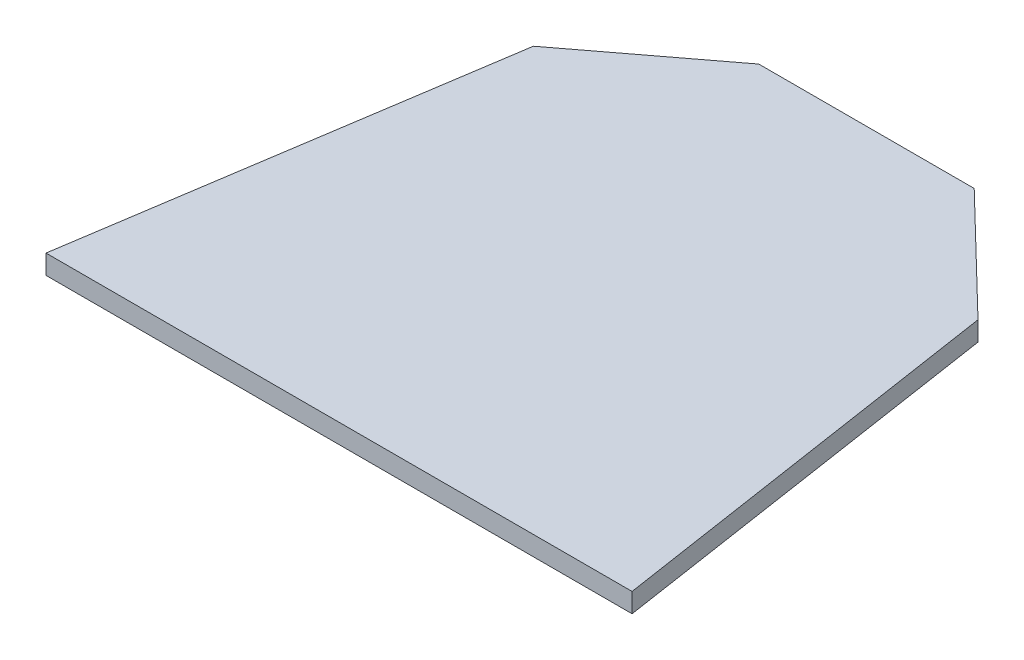
ISO-10303-21;
HEADER;
FILE_DESCRIPTION(('STEP AP214'),'2;1');
FILE_NAME('part.step','',(''),(''),'','','');
FILE_SCHEMA(('AUTOMOTIVE_DESIGN { 1 0 10303 214 1 1 1 1 }'));
ENDSEC;
DATA;
#1=APPLICATION_CONTEXT('core data for automotive mechanical design processes');
#2=APPLICATION_PROTOCOL_DEFINITION('international standard','automotive_design',2000,#1);
#3=PRODUCT_CONTEXT('',#1,'mechanical');
#4=PRODUCT('Part','Part','',(#3));
#5=PRODUCT_RELATED_PRODUCT_CATEGORY('part','',(#4));
#6=PRODUCT_DEFINITION_FORMATION('','',#4);
#7=PRODUCT_DEFINITION_CONTEXT('part definition',#1,'design');
#8=PRODUCT_DEFINITION('design','',#6,#7);
#9=PRODUCT_DEFINITION_SHAPE('','',#8);
#10=(LENGTH_UNIT() NAMED_UNIT(*) SI_UNIT(.MILLI.,.METRE.));
#11=(NAMED_UNIT(*) PLANE_ANGLE_UNIT() SI_UNIT($,.RADIAN.));
#12=(NAMED_UNIT(*) SI_UNIT($,.STERADIAN.) SOLID_ANGLE_UNIT());
#13=UNCERTAINTY_MEASURE_WITH_UNIT(LENGTH_MEASURE(1.E-05),#10,'distance_accuracy_value','');
#14=(GEOMETRIC_REPRESENTATION_CONTEXT(3) GLOBAL_UNCERTAINTY_ASSIGNED_CONTEXT((#13)) GLOBAL_UNIT_ASSIGNED_CONTEXT((#10,
#11,#12)) REPRESENTATION_CONTEXT('',''));
#15=CARTESIAN_POINT('',(0.,0.,0.));
#16=DIRECTION('',(0.,0.,1.));
#17=DIRECTION('',(1.,0.,0.));
#18=AXIS2_PLACEMENT_3D('',#15,#16,#17);
#19=CARTESIAN_POINT('',(0.,2.,0.));
#20=DIRECTION('',(0.,0.,-1.));
#21=DIRECTION('',(-1.,0.,0.));
#22=AXIS2_PLACEMENT_3D('',#19,#20,#21);
#23=PLANE('',#22);
#24=DIRECTION('',(1.,0.,0.));
#25=VECTOR('',#24,1.);
#26=CARTESIAN_POINT('',(0.,0.,0.));
#27=LINE('',#26,#25);
#28=CARTESIAN_POINT('',(0.,0.,0.));
#29=VERTEX_POINT('',#28);
#30=CARTESIAN_POINT('',(60.5101327695278,0.,0.));
#31=VERTEX_POINT('',#30);
#32=EDGE_CURVE('E128',#29,#31,#27,.T.);
#33=ORIENTED_EDGE('',*,*,#32,.T.);
#34=DIRECTION('',(0.,-1.,0.));
#35=VECTOR('',#34,1.);
#36=CARTESIAN_POINT('',(60.5101327695278,2.,0.));
#37=LINE('',#36,#35);
#38=CARTESIAN_POINT('',(60.5101327695278,2.,0.));
#39=VERTEX_POINT('',#38);
#40=EDGE_CURVE('E11',#39,#31,#37,.T.);
#41=ORIENTED_EDGE('',*,*,#40,.F.);
#42=DIRECTION('',(1.,0.,0.));
#43=VECTOR('',#42,1.);
#44=CARTESIAN_POINT('',(0.,2.,0.));
#45=LINE('',#44,#43);
#46=CARTESIAN_POINT('',(0.,2.,0.));
#47=VERTEX_POINT('',#46);
#48=EDGE_CURVE('E144',#47,#39,#45,.T.);
#49=ORIENTED_EDGE('',*,*,#48,.F.);
#50=DIRECTION('',(0.,-1.,0.));
#51=VECTOR('',#50,1.);
#52=CARTESIAN_POINT('',(0.,2.,0.));
#53=LINE('',#52,#51);
#54=EDGE_CURVE('E124',#47,#29,#53,.T.);
#55=ORIENTED_EDGE('',*,*,#54,.T.);
#56=EDGE_LOOP('',(#33,#41,#49,#55));
#57=FACE_BOUND('',#56,.T.);
#58=ADVANCED_FACE('F39',(#57),#23,.F.);
#59=CARTESIAN_POINT('',(60.5101327695278,2.,0.));
#60=DIRECTION('',(-0.988543541670896,0.,0.150935967286669));
#61=DIRECTION('',(0.150935967286669,0.,0.988543541670896));
#62=AXIS2_PLACEMENT_3D('',#59,#60,#61);
#63=PLANE('',#62);
#64=DIRECTION('',(-0.150935967286669,0.,-0.988543541670895));
#65=VECTOR('',#64,1.);
#66=CARTESIAN_POINT('',(60.5101327695278,0.,0.));
#67=LINE('',#66,#65);
#68=CARTESIAN_POINT('',(54.0745583670512,0.,-42.1493009709734));
#69=VERTEX_POINT('',#68);
#70=EDGE_CURVE('E132',#31,#69,#67,.T.);
#71=ORIENTED_EDGE('',*,*,#70,.T.);
#72=DIRECTION('',(0.,-1.,0.));
#73=VECTOR('',#72,1.);
#74=CARTESIAN_POINT('',(54.0745583670512,2.,-42.1493009709734));
#75=LINE('',#74,#73);
#76=CARTESIAN_POINT('',(54.0745583670512,2.,-42.1493009709734));
#77=VERTEX_POINT('',#76);
#78=EDGE_CURVE('E48',#77,#69,#75,.T.);
#79=ORIENTED_EDGE('',*,*,#78,.F.);
#80=DIRECTION('',(-0.150935967286669,0.,-0.988543541670895));
#81=VECTOR('',#80,1.);
#82=CARTESIAN_POINT('',(60.5101327695278,2.,0.));
#83=LINE('',#82,#81);
#84=EDGE_CURVE('E93',#39,#77,#83,.T.);
#85=ORIENTED_EDGE('',*,*,#84,.F.);
#86=ORIENTED_EDGE('',*,*,#40,.T.);
#87=EDGE_LOOP('',(#71,#79,#85,#86));
#88=FACE_BOUND('',#87,.T.);
#89=ADVANCED_FACE('F172',(#88),#63,.F.);
#90=CARTESIAN_POINT('',(54.0745583670512,2.,-42.1493009709734));
#91=DIRECTION('',(-0.695214186381072,0.,0.718802639849426));
#92=DIRECTION('',(0.718802639849426,0.,0.695214186381072));
#93=AXIS2_PLACEMENT_3D('',#90,#91,#92);
#94=PLANE('',#93);
#95=DIRECTION('',(-0.718802639849426,0.,-0.695214186381072));
#96=VECTOR('',#95,1.);
#97=CARTESIAN_POINT('',(54.0745583670512,0.,-42.1493009709734));
#98=LINE('',#97,#96);
#99=CARTESIAN_POINT('',(42.1382999084905,0.,-53.6938554184094));
#100=VERTEX_POINT('',#99);
#101=EDGE_CURVE('E135',#69,#100,#98,.T.);
#102=ORIENTED_EDGE('',*,*,#101,.T.);
#103=DIRECTION('',(0.,-1.,0.));
#104=VECTOR('',#103,1.);
#105=CARTESIAN_POINT('',(42.1382999084905,2.,-53.6938554184094));
#106=LINE('',#105,#104);
#107=CARTESIAN_POINT('',(42.1382999084905,2.,-53.6938554184094));
#108=VERTEX_POINT('',#107);
#109=EDGE_CURVE('E117',#108,#100,#106,.T.);
#110=ORIENTED_EDGE('',*,*,#109,.F.);
#111=DIRECTION('',(-0.718802639849426,0.,-0.695214186381072));
#112=VECTOR('',#111,1.);
#113=CARTESIAN_POINT('',(54.0745583670512,2.,-42.1493009709734));
#114=LINE('',#113,#112);
#115=EDGE_CURVE('E106',#77,#108,#114,.T.);
#116=ORIENTED_EDGE('',*,*,#115,.F.);
#117=ORIENTED_EDGE('',*,*,#78,.T.);
#118=EDGE_LOOP('',(#102,#110,#116,#117));
#119=FACE_BOUND('',#118,.T.);
#120=ADVANCED_FACE('F154',(#119),#94,.F.);
#121=CARTESIAN_POINT('',(42.1382999084905,2.,-53.6938554184094));
#122=DIRECTION('',(0.,0.,1.));
#123=DIRECTION('',(1.,0.,0.));
#124=AXIS2_PLACEMENT_3D('',#121,#122,#123);
#125=PLANE('',#124);
#126=DIRECTION('',(-1.,0.,0.));
#127=VECTOR('',#126,1.);
#128=CARTESIAN_POINT('',(42.1382999084905,0.,-53.6938554184094));
#129=LINE('',#128,#127);
#130=CARTESIAN_POINT('',(19.8982463869477,0.,-53.6938554184094));
#131=VERTEX_POINT('',#130);
#132=EDGE_CURVE('E115',#100,#131,#129,.T.);
#133=ORIENTED_EDGE('',*,*,#132,.T.);
#134=DIRECTION('',(0.,-1.,0.));
#135=VECTOR('',#134,1.);
#136=CARTESIAN_POINT('',(19.8982463869477,2.,-53.6938554184094));
#137=LINE('',#136,#135);
#138=CARTESIAN_POINT('',(19.8982463869477,2.,-53.6938554184094));
#139=VERTEX_POINT('',#138);
#140=EDGE_CURVE('E112',#139,#131,#137,.T.);
#141=ORIENTED_EDGE('',*,*,#140,.F.);
#142=DIRECTION('',(-1.,0.,0.));
#143=VECTOR('',#142,1.);
#144=CARTESIAN_POINT('',(42.1382999084905,2.,-53.6938554184094));
#145=LINE('',#144,#143);
#146=EDGE_CURVE('E100',#108,#139,#145,.T.);
#147=ORIENTED_EDGE('',*,*,#146,.F.);
#148=ORIENTED_EDGE('',*,*,#109,.T.);
#149=EDGE_LOOP('',(#133,#141,#147,#148));
#150=FACE_BOUND('',#149,.T.);
#151=ADVANCED_FACE('F113',(#150),#125,.F.);
#152=CARTESIAN_POINT('',(19.8982463869477,2.,-53.6938554184094));
#153=DIRECTION('',(0.60437936380127,0.,0.796696670390414));
#154=DIRECTION('',(0.796696670390414,0.,-0.60437936380127));
#155=AXIS2_PLACEMENT_3D('',#152,#153,#154);
#156=PLANE('',#155);
#157=DIRECTION('',(-0.796696670390414,0.,0.60437936380127));
#158=VECTOR('',#157,1.);
#159=CARTESIAN_POINT('',(19.8982463869477,0.,-53.6938554184094));
#160=LINE('',#159,#158);
#161=CARTESIAN_POINT('',(6.66553893152044,0.,-43.6554360167565));
#162=VERTEX_POINT('',#161);
#163=EDGE_CURVE('E79',#131,#162,#160,.T.);
#164=ORIENTED_EDGE('',*,*,#163,.T.);
#165=DIRECTION('',(0.,-1.,0.));
#166=VECTOR('',#165,1.);
#167=CARTESIAN_POINT('',(6.66553893152044,2.,-43.6554360167565));
#168=LINE('',#167,#166);
#169=CARTESIAN_POINT('',(6.66553893152044,2.,-43.6554360167565));
#170=VERTEX_POINT('',#169);
#171=EDGE_CURVE('E118',#170,#162,#168,.T.);
#172=ORIENTED_EDGE('',*,*,#171,.F.);
#173=DIRECTION('',(-0.796696670390414,0.,0.60437936380127));
#174=VECTOR('',#173,1.);
#175=CARTESIAN_POINT('',(19.8982463869477,2.,-53.6938554184094));
#176=LINE('',#175,#174);
#177=EDGE_CURVE('E104',#139,#170,#176,.T.);
#178=ORIENTED_EDGE('',*,*,#177,.F.);
#179=ORIENTED_EDGE('',*,*,#140,.T.);
#180=EDGE_LOOP('',(#164,#172,#178,#179));
#181=FACE_BOUND('',#180,.T.);
#182=ADVANCED_FACE('F120',(#181),#156,.F.);
#183=CARTESIAN_POINT('',(6.66553893152044,2.,-43.6554360167565));
#184=DIRECTION('',(0.988543541670896,0.,0.15093596728667));
#185=DIRECTION('',(0.15093596728667,0.,-0.988543541670896));
#186=AXIS2_PLACEMENT_3D('',#183,#184,#185);
#187=PLANE('',#186);
#188=DIRECTION('',(-0.15093596728667,0.,0.988543541670896));
#189=VECTOR('',#188,1.);
#190=CARTESIAN_POINT('',(6.66553893152044,0.,-43.6554360167565));
#191=LINE('',#190,#189);
#192=EDGE_CURVE('E85',#162,#29,#191,.T.);
#193=ORIENTED_EDGE('',*,*,#192,.T.);
#194=ORIENTED_EDGE('',*,*,#54,.F.);
#195=DIRECTION('',(-0.15093596728667,0.,0.988543541670896));
#196=VECTOR('',#195,1.);
#197=CARTESIAN_POINT('',(6.66553893152044,2.,-43.6554360167565));
#198=LINE('',#197,#196);
#199=EDGE_CURVE('E56',#170,#47,#198,.T.);
#200=ORIENTED_EDGE('',*,*,#199,.F.);
#201=ORIENTED_EDGE('',*,*,#171,.T.);
#202=EDGE_LOOP('',(#193,#194,#200,#201));
#203=FACE_BOUND('',#202,.T.);
#204=ADVANCED_FACE('F161',(#203),#187,.F.);
#205=CARTESIAN_POINT('',(0.,2.,0.));
#206=DIRECTION('',(0.,1.,0.));
#207=DIRECTION('',(0.,0.,1.));
#208=AXIS2_PLACEMENT_3D('',#205,#206,#207);
#209=PLANE('',#208);
#210=ORIENTED_EDGE('',*,*,#48,.T.);
#211=ORIENTED_EDGE('',*,*,#84,.T.);
#212=ORIENTED_EDGE('',*,*,#115,.T.);
#213=ORIENTED_EDGE('',*,*,#146,.T.);
#214=ORIENTED_EDGE('',*,*,#177,.T.);
#215=ORIENTED_EDGE('',*,*,#199,.T.);
#216=EDGE_LOOP('',(#210,#211,#212,#213,#214,#215));
#217=FACE_BOUND('',#216,.T.);
#218=ADVANCED_FACE('F102',(#217),#209,.T.);
#219=CARTESIAN_POINT('',(0.,0.,0.));
#220=DIRECTION('',(0.,1.,0.));
#221=DIRECTION('',(0.,0.,1.));
#222=AXIS2_PLACEMENT_3D('',#219,#220,#221);
#223=PLANE('',#222);
#224=ORIENTED_EDGE('',*,*,#32,.F.);
#225=ORIENTED_EDGE('',*,*,#192,.F.);
#226=ORIENTED_EDGE('',*,*,#163,.F.);
#227=ORIENTED_EDGE('',*,*,#132,.F.);
#228=ORIENTED_EDGE('',*,*,#101,.F.);
#229=ORIENTED_EDGE('',*,*,#70,.F.);
#230=EDGE_LOOP('',(#224,#225,#226,#227,#228,#229));
#231=FACE_BOUND('',#230,.T.);
#232=ADVANCED_FACE('F157',(#231),#223,.F.);
#233=CLOSED_SHELL('',(#58,#89,#120,#151,#182,#204,#218,#232));
#234=MANIFOLD_SOLID_BREP('B2',#233);
#235=ADVANCED_BREP_SHAPE_REPRESENTATION('',(#18,#234),#14);
#236=SHAPE_DEFINITION_REPRESENTATION(#9,#235);
ENDSEC;
END-ISO-10303-21;
